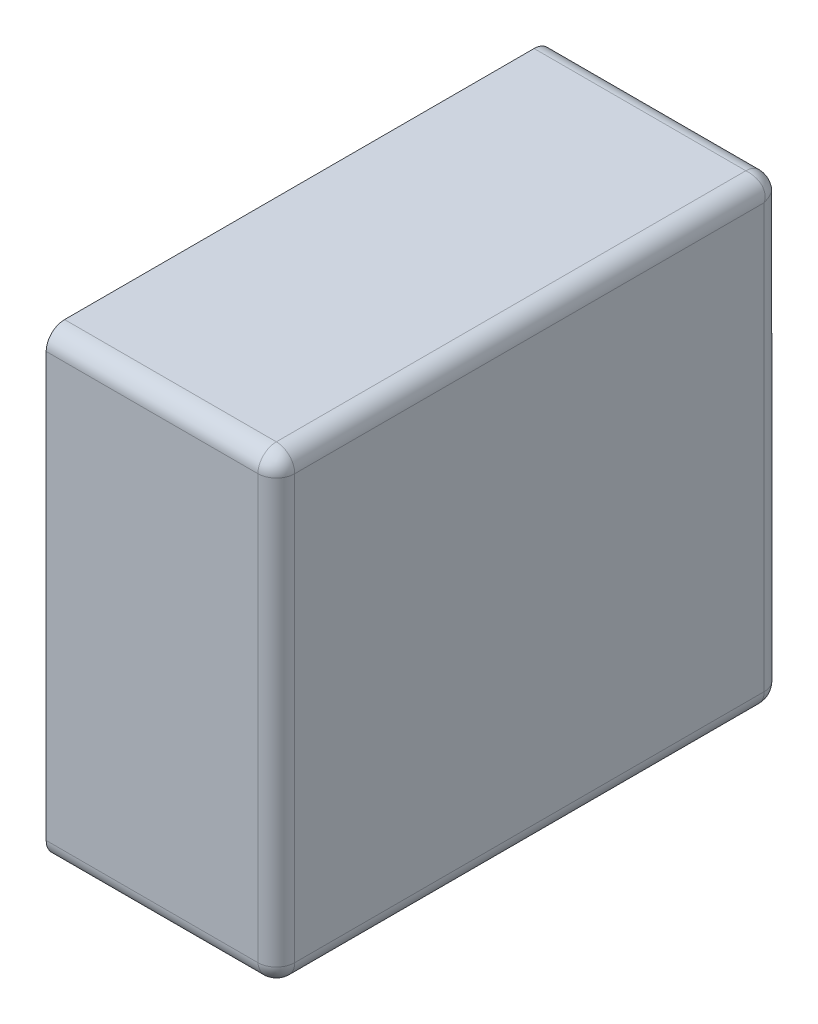
ISO-10303-21;
HEADER;
FILE_DESCRIPTION(('STEP AP214'),'2;1');
FILE_NAME('part.step','',(''),(''),'','','');
FILE_SCHEMA(('AUTOMOTIVE_DESIGN { 1 0 10303 214 1 1 1 1 }'));
ENDSEC;
DATA;
#1=APPLICATION_CONTEXT('core data for automotive mechanical design processes');
#2=APPLICATION_PROTOCOL_DEFINITION('international standard','automotive_design',2000,#1);
#3=PRODUCT_CONTEXT('',#1,'mechanical');
#4=PRODUCT('Part','Part','',(#3));
#5=PRODUCT_RELATED_PRODUCT_CATEGORY('part','',(#4));
#6=PRODUCT_DEFINITION_FORMATION('','',#4);
#7=PRODUCT_DEFINITION_CONTEXT('part definition',#1,'design');
#8=PRODUCT_DEFINITION('design','',#6,#7);
#9=PRODUCT_DEFINITION_SHAPE('','',#8);
#10=(LENGTH_UNIT() NAMED_UNIT(*) SI_UNIT(.MILLI.,.METRE.));
#11=(NAMED_UNIT(*) PLANE_ANGLE_UNIT() SI_UNIT($,.RADIAN.));
#12=(NAMED_UNIT(*) SI_UNIT($,.STERADIAN.) SOLID_ANGLE_UNIT());
#13=UNCERTAINTY_MEASURE_WITH_UNIT(LENGTH_MEASURE(1.E-05),#10,'distance_accuracy_value','');
#14=(GEOMETRIC_REPRESENTATION_CONTEXT(3) GLOBAL_UNCERTAINTY_ASSIGNED_CONTEXT((#13)) GLOBAL_UNIT_ASSIGNED_CONTEXT((#10,
#11,#12)) REPRESENTATION_CONTEXT('',''));
#15=CARTESIAN_POINT('',(0.,0.,0.));
#16=DIRECTION('',(0.,0.,1.));
#17=DIRECTION('',(1.,0.,0.));
#18=AXIS2_PLACEMENT_3D('',#15,#16,#17);
#19=CARTESIAN_POINT('',(0.28,0.411666689445808,0.02));
#20=DIRECTION('',(-0.816496580927727,-0.408248290463862,-0.408248290463863));
#21=DIRECTION('',(0.577350269189625,-0.577350269189626,-0.577350269189626));
#22=AXIS2_PLACEMENT_3D('',#19,#20,#21);
#23=SPHERICAL_SURFACE('',#22,0.02);
#24=CARTESIAN_POINT('',(0.28,0.411666689445808,0.02));
#25=DIRECTION('',(1.,0.,0.));
#26=DIRECTION('',(0.,0.,-1.));
#27=AXIS2_PLACEMENT_3D('',#24,#25,#26);
#28=CIRCLE('',#27,0.02);
#29=CARTESIAN_POINT('',(0.28,0.391666689445808,0.02));
#30=VERTEX_POINT('',#29);
#31=CARTESIAN_POINT('',(0.28,0.411666689445808,0.));
#32=VERTEX_POINT('',#31);
#33=EDGE_CURVE('E11',#30,#32,#28,.T.);
#34=ORIENTED_EDGE('',*,*,#33,.T.);
#35=CARTESIAN_POINT('',(0.28,0.411666689445808,0.02));
#36=DIRECTION('',(0.,-1.,0.));
#37=DIRECTION('',(1.,0.,0.));
#38=AXIS2_PLACEMENT_3D('',#35,#36,#37);
#39=CIRCLE('',#38,0.02);
#40=CARTESIAN_POINT('',(0.3,0.411666689445808,0.02));
#41=VERTEX_POINT('',#40);
#42=EDGE_CURVE('E24',#32,#41,#39,.T.);
#43=ORIENTED_EDGE('',*,*,#42,.T.);
#44=CARTESIAN_POINT('',(0.28,0.411666689445808,0.02));
#45=DIRECTION('',(0.,0.,-1.));
#46=DIRECTION('',(0.,-1.,0.));
#47=AXIS2_PLACEMENT_3D('',#44,#45,#46);
#48=CIRCLE('',#47,0.02);
#49=EDGE_CURVE('E287',#41,#30,#48,.T.);
#50=ORIENTED_EDGE('',*,*,#49,.T.);
#51=EDGE_LOOP('',(#34,#43,#50));
#52=FACE_BOUND('',#51,.T.);
#53=ADVANCED_FACE('F17',(#52),#23,.T.);
#54=CARTESIAN_POINT('',(0.28,0.411666689445808,0.53));
#55=DIRECTION('',(-0.408248290463862,-0.816496580927726,-0.408248290463864));
#56=DIRECTION('',(0.577350269189626,-0.577350269189626,0.577350269189626));
#57=AXIS2_PLACEMENT_3D('',#54,#55,#56);
#58=SPHERICAL_SURFACE('',#57,0.02);
#59=CARTESIAN_POINT('',(0.28,0.411666689445808,0.55));
#60=CARTESIAN_POINT('',(0.280022590656353,0.411334148474741,0.550000008125587));
#61=CARTESIAN_POINT('',(0.280048467324623,0.411001844995877,0.54999166852702));
#62=CARTESIAN_POINT('',(0.280106156478249,0.410337079746307,0.549958278226015));
#63=CARTESIAN_POINT('',(0.280137995200576,0.410004624017193,0.549933152347223));
#64=CARTESIAN_POINT('',(0.280206893868657,0.409340595003377,0.549866039031705));
#65=CARTESIAN_POINT('',(0.280243974413334,0.409009030727827,0.549823983801023));
#66=CARTESIAN_POINT('',(0.280322608326683,0.408347802787663,0.549722948959342));
#67=CARTESIAN_POINT('',(0.2803641771601,0.40801815010292,0.549663909585364));
#68=CARTESIAN_POINT('',(0.280451011501145,0.407361750546147,0.549528916956939));
#69=CARTESIAN_POINT('',(0.280496287947044,0.407035015675078,0.549452912423427));
#70=CARTESIAN_POINT('',(0.28058973767065,0.406385436639111,0.54928407811241));
#71=CARTESIAN_POINT('',(0.280637918049141,0.406062604537353,0.549191205873748));
#72=CARTESIAN_POINT('',(0.28073635687823,0.405421792978829,0.548988802105101));
#73=CARTESIAN_POINT('',(0.28078661935037,0.405103824708536,0.548879237125614));
#74=CARTESIAN_POINT('',(0.28088838941963,0.404473676032253,0.548643691360587));
#75=CARTESIAN_POINT('',(0.280939898771582,0.40416150502494,0.548517686194392));
#76=CARTESIAN_POINT('',(0.281043320324341,0.403543856078687,0.548249580526752));
#77=CARTESIAN_POINT('',(0.281095232865489,0.403238384878659,0.548107464633685));
#78=CARTESIAN_POINT('',(0.28119861409936,0.402635007501095,0.547807534142986));
#79=CARTESIAN_POINT('',(0.281250082594975,0.402337104579366,0.547649712927951));
#80=CARTESIAN_POINT('',(0.281351729565189,0.401749699416991,0.547318843351742));
#81=CARTESIAN_POINT('',(0.281401908192211,0.401460196183228,0.547145796800535));
#82=CARTESIAN_POINT('',(0.28150013473126,0.400890386886022,0.546785021438906));
#83=CARTESIAN_POINT('',(0.281548184027282,0.400610074880339,0.546597302391137));
#84=CARTESIAN_POINT('',(0.281641321625956,0.400059402677607,0.546207798282272));
#85=CARTESIAN_POINT('',(0.281686413406471,0.399789030962054,0.546006030339392));
#86=CARTESIAN_POINT('',(0.28177282100519,0.399258949646601,0.545589113715835));
#87=CARTESIAN_POINT('',(0.281814143222991,0.398999222404694,0.545373988796018));
#88=CARTESIAN_POINT('',(0.281892216861792,0.398491093743793,0.544931109843732));
#89=CARTESIAN_POINT('',(0.281928978383083,0.398242668098216,0.544703385393971));
#90=CARTESIAN_POINT('',(0.281997160659628,0.397757757689727,0.54423612233739));
#91=CARTESIAN_POINT('',(0.28202859593171,0.397521241746488,0.543996618215752));
#92=CARTESIAN_POINT('',(0.282085385217584,0.397060715335747,0.543506670756099));
#93=CARTESIAN_POINT('',(0.28211075880361,0.396836666462132,0.543256265798536));
#94=CARTESIAN_POINT('',(0.282154718170381,0.396401586733097,0.542745447935608));
#95=CARTESIAN_POINT('',(0.282173329127303,0.396190510075537,0.542485076223237));
#96=CARTESIAN_POINT('',(0.282203094935471,0.395781833927346,0.541955308494531));
#97=CARTESIAN_POINT('',(0.2822142810123,0.395584181174223,0.541685955339434));
#98=CARTESIAN_POINT('',(0.282228571117403,0.395202757491672,0.541139256511542));
#99=CARTESIAN_POINT('',(0.282231712751129,0.395018925884465,0.540861954178094));
#100=CARTESIAN_POINT('',(0.282229334285304,0.394665493809617,0.540300432434902));
#101=CARTESIAN_POINT('',(0.282223858375641,0.394495825406103,0.540016255624191));
#102=CARTESIAN_POINT('',(0.282203715057505,0.394171013111566,0.539442099273697));
#103=CARTESIAN_POINT('',(0.28218909849248,0.394015794297806,0.539152160365533));
#104=CARTESIAN_POINT('',(0.282150197448733,0.393720118275401,0.538567628183011));
#105=CARTESIAN_POINT('',(0.28212597039261,0.393579579543217,0.538273072358095));
#106=CARTESIAN_POINT('',(0.282067428373197,0.393313444361489,0.537680483339179));
#107=CARTESIAN_POINT('',(0.282033177188287,0.393187760288434,0.537382483235147));
#108=CARTESIAN_POINT('',(0.28195422644503,0.392951458983836,0.536784206815382));
#109=CARTESIAN_POINT('',(0.281909596642951,0.392840748641457,0.536483958108745));
#110=CARTESIAN_POINT('',(0.281809589319757,0.392634463115031,0.535882401170781));
#111=CARTESIAN_POINT('',(0.281754287007639,0.392538790058148,0.535581114055278));
#112=CARTESIAN_POINT('',(0.281632702159367,0.392362593769109,0.534978718554174));
#113=CARTESIAN_POINT('',(0.281566499584933,0.392281968717724,0.534677623814978));
#114=CARTESIAN_POINT('',(0.281422937490544,0.392135823168081,0.534076824171009));
#115=CARTESIAN_POINT('',(0.281345661932538,0.392070197866407,0.533777124916909));
#116=CARTESIAN_POINT('',(0.281221092947844,0.39198286595166,0.533328778203));
#117=CARTESIAN_POINT('',(0.281178255552711,0.391955665383831,0.533179933041728));
#118=CARTESIAN_POINT('',(0.281089772466679,0.391904985889448,0.532883054971346));
#119=CARTESIAN_POINT('',(0.281044137776449,0.391881493538696,0.532735021096781));
#120=CARTESIAN_POINT('',(0.280950059792531,0.391838212101501,0.532439925078264));
#121=CARTESIAN_POINT('',(0.280901627595711,0.391818409544562,0.532292861368746));
#122=CARTESIAN_POINT('',(0.280801956801604,0.391782484251369,0.531999856728976));
#123=CARTESIAN_POINT('',(0.280750729367382,0.391766348041082,0.531853913656674));
#124=CARTESIAN_POINT('',(0.280645475074276,0.391737729487318,0.531563302522279));
#125=CARTESIAN_POINT('',(0.280591459405113,0.391725233700399,0.53141863173285));
#126=CARTESIAN_POINT('',(0.280480639915912,0.391703866846108,0.531130715857044));
#127=CARTESIAN_POINT('',(0.28042384727353,0.391694982403244,0.530987467462735));
#128=CARTESIAN_POINT('',(0.28030748910873,0.391680806437444,0.530702545780637));
#129=CARTESIAN_POINT('',(0.280247934713586,0.391675501642837,0.530560868611608));
#130=CARTESIAN_POINT('',(0.280126073989553,0.391668449415601,0.530279238132867));
#131=CARTESIAN_POINT('',(0.280063778692528,0.391666688855447,0.530139280377173));
#132=CARTESIAN_POINT('',(0.28,0.391666689445808,0.53));
#133=B_SPLINE_CURVE_WITH_KNOTS('',3,(#59,#60,#61,#62,#63,#64,#65,#66,#67,#68,#69,#70,#71,#72,
#73,#74,#75,#76,#77,#78,#79,#80,#81,#82,#83,#84,#85,#86,#87,#88,#89,#90,#91,#92,#93,#94,#95,#96,
#97,#98,#99,#100,#101,#102,#103,#104,#105,#106,#107,#108,#109,#110,#111,#112,#113,#114,#115,
#116,#117,#118,#119,#120,#121,#122,#123,#124,#125,#126,#127,#128,#129,#130,#131,#132),
.UNSPECIFIED.,.F.,.F.,(4,2,2,2,2,2,2,2,2,2,2,2,2,2,2,2,2,2,2,2,2,2,2,2,2,2,2,2,2,2,2,2,2,2,2,2,
4),(0.,0.000999781399315434,0.00200407054494469,0.00301242204398967,0.00402436601448965,
0.00503941114405152,0.00605704778834479,0.00707675110110719,0.00809798418851637,
0.00912020128176303,0.0101428509224156,0.0111653791557147,0.0121872327272804,0.0132078622788662,
0.0142267255387507,0.0152432905021242,0.0162570385963918,0.0172674678256811,0.0182740958879865,
0.0192764632573068,0.0202741362218111,0.0212667098675017,0.0222538109950035,0.0232351009550113,
0.0242102783855514,0.0251790818315857,0.0261412922246293,0.0270967351970058,0.028045283202207,
0.0285169970770675,0.0289869620593238,0.0294551761814861,0.0299216407082721,0.0303863601707293,
0.0308493423947613,0.0313105985237337,0.0317701430348329),.UNSPECIFIED.);
#134=CARTESIAN_POINT('',(0.28,0.411666689445808,0.55));
#135=VERTEX_POINT('',#134);
#136=CARTESIAN_POINT('',(0.28,0.391666689445808,0.53));
#137=VERTEX_POINT('',#136);
#138=EDGE_CURVE('E285',#135,#137,#133,.T.);
#139=ORIENTED_EDGE('',*,*,#138,.T.);
#140=CARTESIAN_POINT('',(0.28,0.411666689445808,0.53));
#141=DIRECTION('',(0.,0.,1.));
#142=DIRECTION('',(1.,0.,0.));
#143=AXIS2_PLACEMENT_3D('',#140,#141,#142);
#144=CIRCLE('',#143,0.02);
#145=CARTESIAN_POINT('',(0.3,0.411666689445808,0.53));
#146=VERTEX_POINT('',#145);
#147=EDGE_CURVE('E321',#137,#146,#144,.T.);
#148=ORIENTED_EDGE('',*,*,#147,.T.);
#149=CARTESIAN_POINT('',(0.28,0.411666689445808,0.53));
#150=DIRECTION('',(0.,-1.,0.));
#151=DIRECTION('',(0.,0.,1.));
#152=AXIS2_PLACEMENT_3D('',#149,#150,#151);
#153=CIRCLE('',#152,0.02);
#154=EDGE_CURVE('E319',#146,#135,#153,.T.);
#155=ORIENTED_EDGE('',*,*,#154,.T.);
#156=EDGE_LOOP('',(#139,#148,#155));
#157=FACE_BOUND('',#156,.T.);
#158=ADVANCED_FACE('F262',(#157),#58,.T.);
#159=CARTESIAN_POINT('',(0.28,0.411666689445808,0.));
#160=DIRECTION('',(0.,0.,1.));
#161=DIRECTION('',(0.707106781186548,-0.707106781186548,0.));
#162=AXIS2_PLACEMENT_3D('',#159,#160,#161);
#163=CYLINDRICAL_SURFACE('',#162,0.02);
#164=ORIENTED_EDGE('',*,*,#147,.F.);
#165=DIRECTION('',(0.,0.,-1.));
#166=VECTOR('',#165,1.);
#167=CARTESIAN_POINT('',(0.28,0.391666689445808,0.));
#168=LINE('',#167,#166);
#169=EDGE_CURVE('E295',#137,#30,#168,.T.);
#170=ORIENTED_EDGE('',*,*,#169,.T.);
#171=ORIENTED_EDGE('',*,*,#49,.F.);
#172=DIRECTION('',(0.,0.,1.));
#173=VECTOR('',#172,1.);
#174=CARTESIAN_POINT('',(0.3,0.411666689445808,0.));
#175=LINE('',#174,#173);
#176=EDGE_CURVE('E293',#41,#146,#175,.T.);
#177=ORIENTED_EDGE('',*,*,#176,.T.);
#178=EDGE_LOOP('',(#164,#170,#171,#177));
#179=FACE_BOUND('',#178,.T.);
#180=ADVANCED_FACE('F214',(#179),#163,.T.);
#181=CARTESIAN_POINT('',(0.28,0.871666689445808,0.02));
#182=DIRECTION('',(-0.816496580927727,0.408248290463863,-0.408248290463861));
#183=DIRECTION('',(0.577350269189624,0.577350269189626,-0.577350269189628));
#184=AXIS2_PLACEMENT_3D('',#181,#182,#183);
#185=SPHERICAL_SURFACE('',#184,0.02);
#186=CARTESIAN_POINT('',(0.3,0.871666689445808,0.02));
#187=CARTESIAN_POINT('',(0.300000000590361,0.871730468138336,0.0198607196228271));
#188=CARTESIAN_POINT('',(0.299998240030207,0.871792763435361,0.0197207618671335));
#189=CARTESIAN_POINT('',(0.299991187802971,0.871914624159394,0.0194391313883916));
#190=CARTESIAN_POINT('',(0.299985883008364,0.871974178554538,0.0192974542193625));
#191=CARTESIAN_POINT('',(0.299971707042564,0.872090536719337,0.0190125325372646));
#192=CARTESIAN_POINT('',(0.2999628225997,0.87214732936172,0.018869284142956));
#193=CARTESIAN_POINT('',(0.299941455745409,0.872258148850921,0.0185813682671499));
#194=CARTESIAN_POINT('',(0.299928959958489,0.872312164520084,0.0184366974777213));
#195=CARTESIAN_POINT('',(0.299900341404726,0.87241741881319,0.0181460863433266));
#196=CARTESIAN_POINT('',(0.299884205194439,0.872468646247412,0.0180001432710243));
#197=CARTESIAN_POINT('',(0.299848279901245,0.872568317041519,0.0177071386312541));
#198=CARTESIAN_POINT('',(0.299828477344307,0.872616749238339,0.0175600749217357));
#199=CARTESIAN_POINT('',(0.299785195907112,0.872710827222257,0.0172649789032189));
#200=CARTESIAN_POINT('',(0.29976170355636,0.872756461912487,0.0171169450286536));
#201=CARTESIAN_POINT('',(0.299711024061977,0.872844944998519,0.0168200669582726));
#202=CARTESIAN_POINT('',(0.299683823494148,0.872887782393652,0.0166712217969997));
#203=CARTESIAN_POINT('',(0.299596491579401,0.873012351378346,0.0162228750830907));
#204=CARTESIAN_POINT('',(0.299530866277727,0.873089626936352,0.0159231758289911));
#205=CARTESIAN_POINT('',(0.299384720728084,0.873233189030742,0.0153223761850222));
#206=CARTESIAN_POINT('',(0.299304095676699,0.873299391605175,0.0150212814458264));
#207=CARTESIAN_POINT('',(0.29912789938766,0.873420976453447,0.0144188859447218));
#208=CARTESIAN_POINT('',(0.299032226330777,0.873476278765565,0.0141175988292196));
#209=CARTESIAN_POINT('',(0.298825940804351,0.873576286088758,0.0135160418912551));
#210=CARTESIAN_POINT('',(0.298715230461972,0.873620915890838,0.0132157931846183));
#211=CARTESIAN_POINT('',(0.298478929157374,0.873699866634095,0.0126175167648527));
#212=CARTESIAN_POINT('',(0.298353245084319,0.873734117819005,0.012319516660821));
#213=CARTESIAN_POINT('',(0.298087109902591,0.873792659838418,0.0117269276419048));
#214=CARTESIAN_POINT('',(0.297946571170407,0.873816886894541,0.0114323718169895));
#215=CARTESIAN_POINT('',(0.297650895148002,0.873855787938288,0.0108478396344671));
#216=CARTESIAN_POINT('',(0.297495676334242,0.873870404503313,0.0105579007263027));
#217=CARTESIAN_POINT('',(0.297170864039705,0.873890547821449,0.00998374437580919));
#218=CARTESIAN_POINT('',(0.297001195636191,0.873896023731112,0.00969956756509782));
#219=CARTESIAN_POINT('',(0.296647763561343,0.873898402196938,0.00913804582190597));
#220=CARTESIAN_POINT('',(0.296463931954136,0.873895260563211,0.00886074348845804));
#221=CARTESIAN_POINT('',(0.296082508271585,0.873880970458108,0.00831404466056605));
#222=CARTESIAN_POINT('',(0.295884855518462,0.873869784381279,0.00804469150546922));
#223=CARTESIAN_POINT('',(0.29547617937027,0.873840018573111,0.00751492377676279));
#224=CARTESIAN_POINT('',(0.29526510271271,0.87382140761619,0.00725455206439161));
#225=CARTESIAN_POINT('',(0.294830022983676,0.873777448249418,0.00674373420146366));
#226=CARTESIAN_POINT('',(0.294605974110061,0.873752074663392,0.00649332924390105));
#227=CARTESIAN_POINT('',(0.29414544769932,0.873695285377518,0.00600338178424781));
#228=CARTESIAN_POINT('',(0.293908931756081,0.873663850105436,0.00576387766260968));
#229=CARTESIAN_POINT('',(0.293424021347592,0.873595667828891,0.00529661460602938));
#230=CARTESIAN_POINT('',(0.293175595702015,0.8735589063076,0.00506889015626833));
#231=CARTESIAN_POINT('',(0.292667467041114,0.873480832668799,0.00462601120398246));
#232=CARTESIAN_POINT('',(0.292407739799207,0.873439510450998,0.00441088628416467));
#233=CARTESIAN_POINT('',(0.291877658483754,0.873353102852279,0.00399396966060765));
#234=CARTESIAN_POINT('',(0.291607286768201,0.873308011071765,0.00379220171772828));
#235=CARTESIAN_POINT('',(0.291056614565469,0.87321487347309,0.00340269760886272));
#236=CARTESIAN_POINT('',(0.290776302559786,0.873166824177068,0.00321497856109427));
#237=CARTESIAN_POINT('',(0.29020649326258,0.873068597638019,0.00285420319946529));
#238=CARTESIAN_POINT('',(0.289916990028816,0.873018419010997,0.00268115664825788));
#239=CARTESIAN_POINT('',(0.289329584866442,0.872916772040783,0.00235028707204871));
#240=CARTESIAN_POINT('',(0.289031681944713,0.872865303545168,0.00219246585701409));
#241=CARTESIAN_POINT('',(0.288428304567149,0.872761922311297,0.00189253536631513));
#242=CARTESIAN_POINT('',(0.288122833367121,0.872710009770149,0.00175041947324791));
#243=CARTESIAN_POINT('',(0.287505184420868,0.87260658821739,0.00148231380560814));
#244=CARTESIAN_POINT('',(0.287193013413555,0.872555078865438,0.0013563086394134));
#245=CARTESIAN_POINT('',(0.286562864737272,0.872453308796178,0.00112076287438578));
#246=CARTESIAN_POINT('',(0.286244896466979,0.872403046324038,0.00101119789489932));
#247=CARTESIAN_POINT('',(0.285604084908455,0.872304607494949,0.000808794126252359));
#248=CARTESIAN_POINT('',(0.285281252806697,0.872256427116458,0.000715921887590404));
#249=CARTESIAN_POINT('',(0.28463167377073,0.872162977392852,0.000547087576573233));
#250=CARTESIAN_POINT('',(0.284304938899661,0.872117700946953,0.000471083043060662));
#251=CARTESIAN_POINT('',(0.283648539342888,0.872030866605908,0.00033609041463642));
#252=CARTESIAN_POINT('',(0.283318886658145,0.871989297772491,0.000277051040657805));
#253=CARTESIAN_POINT('',(0.282657658717981,0.871910663859142,0.000176016198976993));
#254=CARTESIAN_POINT('',(0.282326094442431,0.871873583314465,0.000133960968295318));
#255=CARTESIAN_POINT('',(0.281662065428615,0.871804684646384,6.68476527768222E-05));
#256=CARTESIAN_POINT('',(0.281329609699501,0.871772845924057,4.17217739850229E-05));
#257=CARTESIAN_POINT('',(0.280664844449931,0.871715156770431,8.33147298054421E-06));
#258=CARTESIAN_POINT('',(0.280332540971067,0.871689280102161,-8.12558677261846E-09));
#259=CARTESIAN_POINT('',(0.28,0.871666689445808,0.));
#260=B_SPLINE_CURVE_WITH_KNOTS('',3,(#186,#187,#188,#189,#190,#191,#192,#193,#194,#195,#196,
#197,#198,#199,#200,#201,#202,#203,#204,#205,#206,#207,#208,#209,#210,#211,#212,#213,#214,#215,
#216,#217,#218,#219,#220,#221,#222,#223,#224,#225,#226,#227,#228,#229,#230,#231,#232,#233,#234,
#235,#236,#237,#238,#239,#240,#241,#242,#243,#244,#245,#246,#247,#248,#249,#250,#251,#252,#253,
#254,#255,#256,#257,#258,#259),.UNSPECIFIED.,.F.,.F.,(4,2,2,2,2,2,2,2,2,2,2,2,2,2,2,2,2,2,2,2,2,
2,2,2,2,2,2,2,2,2,2,2,2,2,2,2,4),(0.,0.000459544511099279,0.000920800640071707,
0.00138378286410355,0.0018485023265608,0.00231496685334685,0.00278318097550909,
0.00325314595776555,0.00372485983262588,0.00467340783782725,0.00562885081020362,
0.00659106120324724,0.00755986464928153,0.00853504207982159,0.00951633203982944,
0.0105034331673312,0.0114960068130218,0.0124936797775262,0.0134960471468464,0.0145026752091519,
0.0155131044384412,0.0165268525327087,0.0175434174960822,0.0185622807559668,0.0195829103075526,
0.0206047638791183,0.0216272921124173,0.0226499417530699,0.0236721588463166,0.0246933919337258,
0.0257130952464882,0.0267307318907814,0.0277457770203433,0.0287577209908433,0.0297660724898882,
0.0307703616355175,0.031770143034833),.UNSPECIFIED.);
#261=CARTESIAN_POINT('',(0.3,0.871666689445808,0.02));
#262=VERTEX_POINT('',#261);
#263=CARTESIAN_POINT('',(0.28,0.871666689445808,0.));
#264=VERTEX_POINT('',#263);
#265=EDGE_CURVE('E236',#262,#264,#260,.T.);
#266=ORIENTED_EDGE('',*,*,#265,.T.);
#267=CARTESIAN_POINT('',(0.28,0.871666689445808,0.02));
#268=DIRECTION('',(1.,0.,0.));
#269=DIRECTION('',(0.,1.,0.));
#270=AXIS2_PLACEMENT_3D('',#267,#268,#269);
#271=CIRCLE('',#270,0.02);
#272=CARTESIAN_POINT('',(0.28,0.891666689445808,0.02));
#273=VERTEX_POINT('',#272);
#274=EDGE_CURVE('E234',#264,#273,#271,.T.);
#275=ORIENTED_EDGE('',*,*,#274,.T.);
#276=CARTESIAN_POINT('',(0.28,0.891666689445808,0.02));
#277=CARTESIAN_POINT('',(0.280332540971067,0.891666697571395,0.0199774093436473));
#278=CARTESIAN_POINT('',(0.280664844449931,0.891658357972828,0.0199515326753773));
#279=CARTESIAN_POINT('',(0.281329609699501,0.891624967671823,0.0198938435217508));
#280=CARTESIAN_POINT('',(0.281662065428615,0.891599841793031,0.0198620047994243));
#281=CARTESIAN_POINT('',(0.282326094442431,0.891532728477513,0.0197931061313426));
#282=CARTESIAN_POINT('',(0.282657658717981,0.891490673246831,0.0197560255866657));
#283=CARTESIAN_POINT('',(0.283318886658145,0.89138963840515,0.0196773916733174));
#284=CARTESIAN_POINT('',(0.283648539342888,0.891330599031172,0.0196358228398999));
#285=CARTESIAN_POINT('',(0.284304938899661,0.891195606402747,0.0195489884988552));
#286=CARTESIAN_POINT('',(0.28463167377073,0.891119601869235,0.0195037120529565));
#287=CARTESIAN_POINT('',(0.285281252806697,0.890950767558218,0.0194102623293496));
#288=CARTESIAN_POINT('',(0.285604084908455,0.890857895319556,0.0193620819508587));
#289=CARTESIAN_POINT('',(0.286244896466979,0.890655491550909,0.0192636431217698));
#290=CARTESIAN_POINT('',(0.286562864737272,0.890545926571422,0.0192133806496299));
#291=CARTESIAN_POINT('',(0.287193013413555,0.890310380806395,0.0191116105803702));
#292=CARTESIAN_POINT('',(0.287505184420868,0.8901843756402,0.0190601012284176));
#293=CARTESIAN_POINT('',(0.288122833367121,0.88991626997256,0.0189566796756587));
#294=CARTESIAN_POINT('',(0.288428304567149,0.889774154079493,0.018904767134511));
#295=CARTESIAN_POINT('',(0.289031681944713,0.889474223588794,0.0188013859006402));
#296=CARTESIAN_POINT('',(0.289329584866442,0.889316402373759,0.0187499174050251));
#297=CARTESIAN_POINT('',(0.289916990028817,0.88898553279755,0.0186482704348113));
#298=CARTESIAN_POINT('',(0.29020649326258,0.888812486246343,0.0185980918077888));
#299=CARTESIAN_POINT('',(0.290776302559786,0.888451710884714,0.0184998652687403));
#300=CARTESIAN_POINT('',(0.291056614565469,0.888263991836945,0.018451815972718));
#301=CARTESIAN_POINT('',(0.291607286768201,0.88787448772808,0.0183586783740435));
#302=CARTESIAN_POINT('',(0.291877658483754,0.8876727197852,0.0183135865935291));
#303=CARTESIAN_POINT('',(0.292407739799207,0.887255803161643,0.0182271789948101));
#304=CARTESIAN_POINT('',(0.292667467041114,0.887040678241826,0.0181858567770088));
#305=CARTESIAN_POINT('',(0.293175595702015,0.88659779928954,0.0181077831382082));
#306=CARTESIAN_POINT('',(0.293424021347592,0.886370074839779,0.0180710216169169));
#307=CARTESIAN_POINT('',(0.293908931756081,0.885902811783198,0.0180028393403716));
#308=CARTESIAN_POINT('',(0.29414544769932,0.88566330766156,0.0179714040682899));
#309=CARTESIAN_POINT('',(0.294605974110061,0.885173360201907,0.0179146147824163));
#310=CARTESIAN_POINT('',(0.294830022983676,0.884922955244344,0.0178892411963896));
#311=CARTESIAN_POINT('',(0.29526510271271,0.884412137381416,0.0178452818296186));
#312=CARTESIAN_POINT('',(0.295476179370271,0.884151765669045,0.0178266708726966));
#313=CARTESIAN_POINT('',(0.295884855518462,0.883621997940339,0.0177969050645286));
#314=CARTESIAN_POINT('',(0.296082508271585,0.883352644785242,0.0177857189876999));
#315=CARTESIAN_POINT('',(0.296463931954136,0.88280594595735,0.0177714288825966));
#316=CARTESIAN_POINT('',(0.296647763561343,0.882528643623902,0.0177682872488705));
#317=CARTESIAN_POINT('',(0.297001195636191,0.88196712188071,0.0177706657146956));
#318=CARTESIAN_POINT('',(0.297170864039705,0.881682945069999,0.0177761416243585));
#319=CARTESIAN_POINT('',(0.297495676334242,0.881108788719505,0.0177962849424949));
#320=CARTESIAN_POINT('',(0.297650895148002,0.880818849811341,0.0178109015075204));
#321=CARTESIAN_POINT('',(0.297946571170407,0.880234317628819,0.0178498025512674));
#322=CARTESIAN_POINT('',(0.298087109902591,0.879939761803903,0.0178740296073897));
#323=CARTESIAN_POINT('',(0.298353245084319,0.879347172784987,0.0179325716268031));
#324=CARTESIAN_POINT('',(0.298478929157374,0.879049172680955,0.0179668228117131));
#325=CARTESIAN_POINT('',(0.298715230461972,0.87845089626119,0.01804577355497));
#326=CARTESIAN_POINT('',(0.298825940804351,0.878150647554553,0.0180904033570495));
#327=CARTESIAN_POINT('',(0.299032226330777,0.877549090616588,0.0181904106802428));
#328=CARTESIAN_POINT('',(0.29912789938766,0.877247803501086,0.0182457129923607));
#329=CARTESIAN_POINT('',(0.299304095676699,0.876645407999982,0.0183672978406332));
#330=CARTESIAN_POINT('',(0.299384720728084,0.876344313260786,0.0184335004150665));
#331=CARTESIAN_POINT('',(0.299530866277727,0.875743513616817,0.0185770625094562));
#332=CARTESIAN_POINT('',(0.299596491579401,0.875443814362717,0.0186543380674616));
#333=CARTESIAN_POINT('',(0.299683823494148,0.874995467648808,0.0187789070521562));
#334=CARTESIAN_POINT('',(0.299711024061977,0.874846622487536,0.0188217444472892));
#335=CARTESIAN_POINT('',(0.29976170355636,0.874549744417154,0.018910227533321));
#336=CARTESIAN_POINT('',(0.299785195907112,0.874401710542589,0.0189558622235505));
#337=CARTESIAN_POINT('',(0.299828477344307,0.874106614524072,0.019049940207469));
#338=CARTESIAN_POINT('',(0.299848279901245,0.873959550814554,0.0190983724042887));
#339=CARTESIAN_POINT('',(0.299884205194439,0.873666546174784,0.0191980431983957));
#340=CARTESIAN_POINT('',(0.299900341404726,0.873520603102481,0.019249270632618));
#341=CARTESIAN_POINT('',(0.299928959958489,0.873229991968087,0.0193545249257238));
#342=CARTESIAN_POINT('',(0.299941455745409,0.873085321178658,0.0194085405948874));
#343=CARTESIAN_POINT('',(0.2999628225997,0.872797405302852,0.0195193600840876));
#344=CARTESIAN_POINT('',(0.299971707042564,0.872654156908544,0.0195761527264704));
#345=CARTESIAN_POINT('',(0.299985883008364,0.872369235226446,0.0196925108912696));
#346=CARTESIAN_POINT('',(0.299991187802971,0.872227558057416,0.0197520652864141));
#347=CARTESIAN_POINT('',(0.299998240030207,0.871945927578675,0.0198739260104468));
#348=CARTESIAN_POINT('',(0.300000000590361,0.871805969822981,0.0199362213074718));
#349=CARTESIAN_POINT('',(0.3,0.871666689445808,0.0199999999999999));
#350=B_SPLINE_CURVE_WITH_KNOTS('',3,(#276,#277,#278,#279,#280,#281,#282,#283,#284,#285,#286,
#287,#288,#289,#290,#291,#292,#293,#294,#295,#296,#297,#298,#299,#300,#301,#302,#303,#304,#305,
#306,#307,#308,#309,#310,#311,#312,#313,#314,#315,#316,#317,#318,#319,#320,#321,#322,#323,#324,
#325,#326,#327,#328,#329,#330,#331,#332,#333,#334,#335,#336,#337,#338,#339,#340,#341,#342,#343,
#344,#345,#346,#347,#348,#349),.UNSPECIFIED.,.F.,.F.,(4,2,2,2,2,2,2,2,2,2,2,2,2,2,2,2,2,2,2,2,2,
2,2,2,2,2,2,2,2,2,2,2,2,2,2,2,4),(0.,0.000999781399315437,0.0020040705449447,
0.00301242204398967,0.00402436601448971,0.00503941114405157,0.00605704778834485,
0.0070767511011072,0.00809798418851638,0.00912020128176308,0.0101428509224156,
0.0111653791557147,0.0121872327272804,0.0132078622788662,0.0142267255387507,0.0152432905021242,
0.0162570385963919,0.0172674678256811,0.0182740958879865,0.0192764632573068,0.0202741362218111,
0.0212667098675017,0.0222538109950035,0.0232351009550113,0.0242102783855514,0.0251790818315857,
0.0261412922246293,0.0270967351970057,0.028045283202207,0.0285169970770674,0.0289869620593239,
0.0294551761814861,0.0299216407082721,0.0303863601707294,0.0308493423947612,0.0313105985237336,
0.031770143034833),.UNSPECIFIED.);
#351=EDGE_CURVE('E182',#273,#262,#350,.T.);
#352=ORIENTED_EDGE('',*,*,#351,.T.);
#353=EDGE_LOOP('',(#266,#275,#352));
#354=FACE_BOUND('',#353,.T.);
#355=ADVANCED_FACE('F209',(#354),#185,.T.);
#356=CARTESIAN_POINT('',(0.2375,0.871666689445808,0.02));
#357=DIRECTION('',(1.,0.,0.));
#358=DIRECTION('',(0.,0.707106781186548,-0.707106781186547));
#359=AXIS2_PLACEMENT_3D('',#356,#357,#358);
#360=CYLINDRICAL_SURFACE('',#359,0.02);
#361=CARTESIAN_POINT('',(0.05,0.871666689445808,0.02));
#362=DIRECTION('',(1.,0.,0.));
#363=DIRECTION('',(0.,0.707106781186548,-0.707106781186547));
#364=AXIS2_PLACEMENT_3D('',#361,#362,#363);
#365=CIRCLE('',#364,0.02);
#366=CARTESIAN_POINT('',(0.05,0.871666689445808,0.));
#367=VERTEX_POINT('',#366);
#368=CARTESIAN_POINT('',(0.05,0.891666689445808,0.02));
#369=VERTEX_POINT('',#368);
#370=EDGE_CURVE('E180',#367,#369,#365,.T.);
#371=ORIENTED_EDGE('',*,*,#370,.T.);
#372=DIRECTION('',(1.,0.,0.));
#373=VECTOR('',#372,1.);
#374=CARTESIAN_POINT('',(0.2375,0.891666689445808,0.02));
#375=LINE('',#374,#373);
#376=EDGE_CURVE('E175',#369,#273,#375,.T.);
#377=ORIENTED_EDGE('',*,*,#376,.T.);
#378=ORIENTED_EDGE('',*,*,#274,.F.);
#379=DIRECTION('',(-1.,0.,0.));
#380=VECTOR('',#379,1.);
#381=CARTESIAN_POINT('',(0.2375,0.871666689445808,0.));
#382=LINE('',#381,#380);
#383=EDGE_CURVE('E170',#264,#367,#382,.T.);
#384=ORIENTED_EDGE('',*,*,#383,.T.);
#385=EDGE_LOOP('',(#371,#377,#378,#384));
#386=FACE_BOUND('',#385,.T.);
#387=ADVANCED_FACE('F205',(#386),#360,.T.);
#388=CARTESIAN_POINT('',(0.28,0.871666689445808,0.53));
#389=DIRECTION('',(0.408248290463863,-0.816496580927726,0.408248290463863));
#390=DIRECTION('',(0.577350269189626,0.577350269189626,0.577350269189626));
#391=AXIS2_PLACEMENT_3D('',#388,#389,#390);
#392=SPHERICAL_SURFACE('',#391,0.02);
#393=CARTESIAN_POINT('',(0.28,0.871666689445808,0.53));
#394=DIRECTION('',(0.,1.,0.));
#395=DIRECTION('',(1.,0.,0.));
#396=AXIS2_PLACEMENT_3D('',#393,#394,#395);
#397=CIRCLE('',#396,0.02);
#398=CARTESIAN_POINT('',(0.28,0.871666689445808,0.55));
#399=VERTEX_POINT('',#398);
#400=CARTESIAN_POINT('',(0.3,0.871666689445808,0.53));
#401=VERTEX_POINT('',#400);
#402=EDGE_CURVE('E168',#399,#401,#397,.T.);
#403=ORIENTED_EDGE('',*,*,#402,.T.);
#404=CARTESIAN_POINT('',(0.28,0.871666689445808,0.53));
#405=DIRECTION('',(0.,0.,1.));
#406=DIRECTION('',(0.,1.,0.));
#407=AXIS2_PLACEMENT_3D('',#404,#405,#406);
#408=CIRCLE('',#407,0.02);
#409=CARTESIAN_POINT('',(0.28,0.891666689445808,0.53));
#410=VERTEX_POINT('',#409);
#411=EDGE_CURVE('E166',#401,#410,#408,.T.);
#412=ORIENTED_EDGE('',*,*,#411,.T.);
#413=CARTESIAN_POINT('',(0.28,0.871666689445808,0.53));
#414=DIRECTION('',(1.,0.,0.));
#415=DIRECTION('',(0.,0.,1.));
#416=AXIS2_PLACEMENT_3D('',#413,#414,#415);
#417=CIRCLE('',#416,0.02);
#418=EDGE_CURVE('E163',#410,#399,#417,.T.);
#419=ORIENTED_EDGE('',*,*,#418,.T.);
#420=EDGE_LOOP('',(#403,#412,#419));
#421=FACE_BOUND('',#420,.T.);
#422=ADVANCED_FACE('F200',(#421),#392,.T.);
#423=CARTESIAN_POINT('',(0.28,0.871666689445808,0.));
#424=DIRECTION('',(0.,0.,1.));
#425=DIRECTION('',(0.707106781186546,0.707106781186549,0.));
#426=AXIS2_PLACEMENT_3D('',#423,#424,#425);
#427=CYLINDRICAL_SURFACE('',#426,0.02);
#428=ORIENTED_EDGE('',*,*,#411,.F.);
#429=DIRECTION('',(0.,0.,-1.));
#430=VECTOR('',#429,1.);
#431=CARTESIAN_POINT('',(0.3,0.871666689445808,0.));
#432=LINE('',#431,#430);
#433=EDGE_CURVE('E158',#401,#262,#432,.T.);
#434=ORIENTED_EDGE('',*,*,#433,.T.);
#435=ORIENTED_EDGE('',*,*,#351,.F.);
#436=DIRECTION('',(0.,0.,1.));
#437=VECTOR('',#436,1.);
#438=CARTESIAN_POINT('',(0.28,0.891666689445808,0.));
#439=LINE('',#438,#437);
#440=EDGE_CURVE('E153',#273,#410,#439,.T.);
#441=ORIENTED_EDGE('',*,*,#440,.T.);
#442=EDGE_LOOP('',(#428,#434,#435,#441));
#443=FACE_BOUND('',#442,.T.);
#444=ADVANCED_FACE('F189',(#443),#427,.T.);
#445=CARTESIAN_POINT('',(0.2375,0.871666689445808,0.53));
#446=DIRECTION('',(-1.,0.,0.));
#447=DIRECTION('',(0.,0.707106781186548,0.707106781186548));
#448=AXIS2_PLACEMENT_3D('',#445,#446,#447);
#449=CYLINDRICAL_SURFACE('',#448,0.02);
#450=CARTESIAN_POINT('',(0.05,0.871666689445808,0.53));
#451=DIRECTION('',(1.,0.,0.));
#452=DIRECTION('',(0.,0.707106781186548,0.707106781186548));
#453=AXIS2_PLACEMENT_3D('',#450,#451,#452);
#454=CIRCLE('',#453,0.02);
#455=CARTESIAN_POINT('',(0.05,0.891666689445808,0.53));
#456=VERTEX_POINT('',#455);
#457=CARTESIAN_POINT('',(0.05,0.871666689445808,0.55));
#458=VERTEX_POINT('',#457);
#459=EDGE_CURVE('E151',#456,#458,#454,.T.);
#460=ORIENTED_EDGE('',*,*,#459,.T.);
#461=DIRECTION('',(1.,0.,0.));
#462=VECTOR('',#461,1.);
#463=CARTESIAN_POINT('',(0.2375,0.871666689445808,0.55));
#464=LINE('',#463,#462);
#465=EDGE_CURVE('E148',#458,#399,#464,.T.);
#466=ORIENTED_EDGE('',*,*,#465,.T.);
#467=ORIENTED_EDGE('',*,*,#418,.F.);
#468=DIRECTION('',(-1.,0.,0.));
#469=VECTOR('',#468,1.);
#470=CARTESIAN_POINT('',(0.2375,0.891666689445808,0.53));
#471=LINE('',#470,#469);
#472=EDGE_CURVE('E145',#410,#456,#471,.T.);
#473=ORIENTED_EDGE('',*,*,#472,.T.);
#474=EDGE_LOOP('',(#460,#466,#467,#473));
#475=FACE_BOUND('',#474,.T.);
#476=ADVANCED_FACE('F199',(#475),#449,.T.);
#477=CARTESIAN_POINT('',(0.28,0.516666689445808,0.53));
#478=DIRECTION('',(0.,1.,0.));
#479=DIRECTION('',(0.707106781186548,0.,0.707106781186548));
#480=AXIS2_PLACEMENT_3D('',#477,#478,#479);
#481=CYLINDRICAL_SURFACE('',#480,0.02);
#482=ORIENTED_EDGE('',*,*,#402,.F.);
#483=DIRECTION('',(0.,-1.,0.));
#484=VECTOR('',#483,1.);
#485=CARTESIAN_POINT('',(0.28,0.516666689445808,0.55));
#486=LINE('',#485,#484);
#487=EDGE_CURVE('E140',#399,#135,#486,.T.);
#488=ORIENTED_EDGE('',*,*,#487,.T.);
#489=ORIENTED_EDGE('',*,*,#154,.F.);
#490=DIRECTION('',(0.,1.,0.));
#491=VECTOR('',#490,1.);
#492=CARTESIAN_POINT('',(0.3,0.516666689445808,0.53));
#493=LINE('',#492,#491);
#494=EDGE_CURVE('E137',#146,#401,#493,.T.);
#495=ORIENTED_EDGE('',*,*,#494,.T.);
#496=EDGE_LOOP('',(#482,#488,#489,#495));
#497=FACE_BOUND('',#496,.T.);
#498=ADVANCED_FACE('F250',(#497),#481,.T.);
#499=CARTESIAN_POINT('',(0.28,0.516666689445808,0.02));
#500=DIRECTION('',(0.,-1.,0.));
#501=DIRECTION('',(0.707106781186548,0.,-0.707106781186547));
#502=AXIS2_PLACEMENT_3D('',#499,#500,#501);
#503=CYLINDRICAL_SURFACE('',#502,0.02);
#504=ORIENTED_EDGE('',*,*,#42,.F.);
#505=DIRECTION('',(0.,1.,0.));
#506=VECTOR('',#505,1.);
#507=CARTESIAN_POINT('',(0.28,0.516666689445808,0.));
#508=LINE('',#507,#506);
#509=EDGE_CURVE('E132',#32,#264,#508,.T.);
#510=ORIENTED_EDGE('',*,*,#509,.T.);
#511=ORIENTED_EDGE('',*,*,#265,.F.);
#512=DIRECTION('',(0.,-1.,0.));
#513=VECTOR('',#512,1.);
#514=CARTESIAN_POINT('',(0.3,0.516666689445808,0.02));
#515=LINE('',#514,#513);
#516=EDGE_CURVE('E127',#262,#41,#515,.T.);
#517=ORIENTED_EDGE('',*,*,#516,.T.);
#518=EDGE_LOOP('',(#504,#510,#511,#517));
#519=FACE_BOUND('',#518,.T.);
#520=ADVANCED_FACE('F240',(#519),#503,.T.);
#521=CARTESIAN_POINT('',(0.1125,0.411666689445808,0.53));
#522=DIRECTION('',(1.,0.,0.));
#523=DIRECTION('',(0.,-0.707106781186548,0.707106781186548));
#524=AXIS2_PLACEMENT_3D('',#521,#522,#523);
#525=CYLINDRICAL_SURFACE('',#524,0.02);
#526=CARTESIAN_POINT('',(0.0500000000000001,0.411666689445808,0.53));
#527=DIRECTION('',(1.,0.,0.));
#528=DIRECTION('',(0.,-0.707106781186548,0.707106781186548));
#529=AXIS2_PLACEMENT_3D('',#526,#527,#528);
#530=CIRCLE('',#529,0.02);
#531=CARTESIAN_POINT('',(0.0500000000000001,0.411666689445808,0.55));
#532=VERTEX_POINT('',#531);
#533=CARTESIAN_POINT('',(0.0500000000000001,0.391666689445808,0.53));
#534=VERTEX_POINT('',#533);
#535=EDGE_CURVE('E125',#532,#534,#530,.T.);
#536=ORIENTED_EDGE('',*,*,#535,.T.);
#537=DIRECTION('',(1.,0.,0.));
#538=VECTOR('',#537,1.);
#539=CARTESIAN_POINT('',(0.1125,0.391666689445808,0.53));
#540=LINE('',#539,#538);
#541=EDGE_CURVE('E109',#534,#137,#540,.T.);
#542=ORIENTED_EDGE('',*,*,#541,.T.);
#543=ORIENTED_EDGE('',*,*,#138,.F.);
#544=DIRECTION('',(-1.,0.,0.));
#545=VECTOR('',#544,1.);
#546=CARTESIAN_POINT('',(0.1125,0.411666689445808,0.55));
#547=LINE('',#546,#545);
#548=EDGE_CURVE('E97',#135,#532,#547,.T.);
#549=ORIENTED_EDGE('',*,*,#548,.T.);
#550=EDGE_LOOP('',(#536,#542,#543,#549));
#551=FACE_BOUND('',#550,.T.);
#552=ADVANCED_FACE('F249',(#551),#525,.T.);
#553=CARTESIAN_POINT('',(0.1125,0.411666689445808,0.02));
#554=DIRECTION('',(-1.,0.,0.));
#555=DIRECTION('',(0.,-0.707106781186548,-0.707106781186547));
#556=AXIS2_PLACEMENT_3D('',#553,#554,#555);
#557=CYLINDRICAL_SURFACE('',#556,0.02);
#558=CARTESIAN_POINT('',(0.0500000000000001,0.411666689445808,0.02));
#559=DIRECTION('',(1.,0.,0.));
#560=DIRECTION('',(0.,-0.707106781186548,-0.707106781186547));
#561=AXIS2_PLACEMENT_3D('',#558,#559,#560);
#562=CIRCLE('',#561,0.02);
#563=CARTESIAN_POINT('',(0.0500000000000001,0.391666689445808,0.02));
#564=VERTEX_POINT('',#563);
#565=CARTESIAN_POINT('',(0.0500000000000001,0.411666689445808,0.));
#566=VERTEX_POINT('',#565);
#567=EDGE_CURVE('E90',#564,#566,#562,.T.);
#568=ORIENTED_EDGE('',*,*,#567,.T.);
#569=DIRECTION('',(1.,0.,0.));
#570=VECTOR('',#569,1.);
#571=CARTESIAN_POINT('',(0.1125,0.411666689445808,0.));
#572=LINE('',#571,#570);
#573=EDGE_CURVE('E98',#566,#32,#572,.T.);
#574=ORIENTED_EDGE('',*,*,#573,.T.);
#575=ORIENTED_EDGE('',*,*,#33,.F.);
#576=DIRECTION('',(-1.,0.,0.));
#577=VECTOR('',#576,1.);
#578=CARTESIAN_POINT('',(0.1125,0.391666689445808,0.02));
#579=LINE('',#578,#577);
#580=EDGE_CURVE('E101',#30,#564,#579,.T.);
#581=ORIENTED_EDGE('',*,*,#580,.T.);
#582=EDGE_LOOP('',(#568,#574,#575,#581));
#583=FACE_BOUND('',#582,.T.);
#584=ADVANCED_FACE('F102',(#583),#557,.T.);
#585=CARTESIAN_POINT('',(0.0500000000000001,0.391666689445808,0.));
#586=DIRECTION('',(0.,-1.,0.));
#587=DIRECTION('',(1.,0.,0.));
#588=AXIS2_PLACEMENT_3D('',#585,#586,#587);
#589=PLANE('',#588);
#590=ORIENTED_EDGE('',*,*,#580,.F.);
#591=ORIENTED_EDGE('',*,*,#169,.F.);
#592=ORIENTED_EDGE('',*,*,#541,.F.);
#593=DIRECTION('',(0.,0.,1.));
#594=VECTOR('',#593,1.);
#595=CARTESIAN_POINT('',(0.0500000000000001,0.391666689445808,0.));
#596=LINE('',#595,#594);
#597=EDGE_CURVE('E93',#564,#534,#596,.T.);
#598=ORIENTED_EDGE('',*,*,#597,.F.);
#599=EDGE_LOOP('',(#590,#591,#592,#598));
#600=FACE_BOUND('',#599,.T.);
#601=ADVANCED_FACE('F107',(#600),#589,.T.);
#602=CARTESIAN_POINT('',(0.175,0.641666689445808,0.55));
#603=DIRECTION('',(0.,0.,1.));
#604=DIRECTION('',(1.,0.,0.));
#605=AXIS2_PLACEMENT_3D('',#602,#603,#604);
#606=PLANE('',#605);
#607=ORIENTED_EDGE('',*,*,#548,.F.);
#608=ORIENTED_EDGE('',*,*,#487,.F.);
#609=ORIENTED_EDGE('',*,*,#465,.F.);
#610=DIRECTION('',(0.,-1.,0.));
#611=VECTOR('',#610,1.);
#612=CARTESIAN_POINT('',(0.0500000000000001,0.391666689445808,0.55));
#613=LINE('',#612,#611);
#614=EDGE_CURVE('E110',#458,#532,#613,.T.);
#615=ORIENTED_EDGE('',*,*,#614,.T.);
#616=EDGE_LOOP('',(#607,#608,#609,#615));
#617=FACE_BOUND('',#616,.T.);
#618=ADVANCED_FACE('F340',(#617),#606,.T.);
#619=CARTESIAN_POINT('',(0.3,0.391666689445808,0.));
#620=DIRECTION('',(1.,0.,0.));
#621=DIRECTION('',(0.,1.,0.));
#622=AXIS2_PLACEMENT_3D('',#619,#620,#621);
#623=PLANE('',#622);
#624=ORIENTED_EDGE('',*,*,#433,.F.);
#625=ORIENTED_EDGE('',*,*,#494,.F.);
#626=ORIENTED_EDGE('',*,*,#176,.F.);
#627=ORIENTED_EDGE('',*,*,#516,.F.);
#628=EDGE_LOOP('',(#624,#625,#626,#627));
#629=FACE_BOUND('',#628,.T.);
#630=ADVANCED_FACE('F299',(#629),#623,.T.);
#631=CARTESIAN_POINT('',(0.05,0.891666689445808,0.));
#632=DIRECTION('',(-1.,0.,0.));
#633=DIRECTION('',(0.,-1.,0.));
#634=AXIS2_PLACEMENT_3D('',#631,#632,#633);
#635=PLANE('',#634);
#636=ORIENTED_EDGE('',*,*,#567,.F.);
#637=ORIENTED_EDGE('',*,*,#597,.T.);
#638=ORIENTED_EDGE('',*,*,#535,.F.);
#639=ORIENTED_EDGE('',*,*,#614,.F.);
#640=ORIENTED_EDGE('',*,*,#459,.F.);
#641=DIRECTION('',(0.,0.,1.));
#642=VECTOR('',#641,1.);
#643=CARTESIAN_POINT('',(0.05,0.891666689445808,0.));
#644=LINE('',#643,#642);
#645=EDGE_CURVE('E113',#369,#456,#644,.T.);
#646=ORIENTED_EDGE('',*,*,#645,.F.);
#647=ORIENTED_EDGE('',*,*,#370,.F.);
#648=DIRECTION('',(0.,1.,0.));
#649=VECTOR('',#648,1.);
#650=CARTESIAN_POINT('',(0.0500000000000001,0.391666689445808,0.));
#651=LINE('',#650,#649);
#652=EDGE_CURVE('E95',#566,#367,#651,.T.);
#653=ORIENTED_EDGE('',*,*,#652,.F.);
#654=EDGE_LOOP('',(#636,#637,#638,#639,#640,#646,#647,#653));
#655=FACE_BOUND('',#654,.T.);
#656=ADVANCED_FACE('F91',(#655),#635,.T.);
#657=CARTESIAN_POINT('',(0.3,0.891666689445808,0.));
#658=DIRECTION('',(0.,1.,0.));
#659=DIRECTION('',(-1.,0.,0.));
#660=AXIS2_PLACEMENT_3D('',#657,#658,#659);
#661=PLANE('',#660);
#662=ORIENTED_EDGE('',*,*,#376,.F.);
#663=ORIENTED_EDGE('',*,*,#645,.T.);
#664=ORIENTED_EDGE('',*,*,#472,.F.);
#665=ORIENTED_EDGE('',*,*,#440,.F.);
#666=EDGE_LOOP('',(#662,#663,#664,#665));
#667=FACE_BOUND('',#666,.T.);
#668=ADVANCED_FACE('F312',(#667),#661,.T.);
#669=CARTESIAN_POINT('',(0.175,0.641666689445808,0.));
#670=DIRECTION('',(0.,0.,1.));
#671=DIRECTION('',(1.,0.,0.));
#672=AXIS2_PLACEMENT_3D('',#669,#670,#671);
#673=PLANE('',#672);
#674=ORIENTED_EDGE('',*,*,#573,.F.);
#675=ORIENTED_EDGE('',*,*,#652,.T.);
#676=ORIENTED_EDGE('',*,*,#383,.F.);
#677=ORIENTED_EDGE('',*,*,#509,.F.);
#678=EDGE_LOOP('',(#674,#675,#676,#677));
#679=FACE_BOUND('',#678,.T.);
#680=ADVANCED_FACE('F306',(#679),#673,.F.);
#681=CLOSED_SHELL('',(#53,#158,#180,#355,#387,#422,#444,#476,#498,#520,#552,#584,#601,#618,#630,
#656,#668,#680));
#682=MANIFOLD_SOLID_BREP('B1',#681);
#683=ADVANCED_BREP_SHAPE_REPRESENTATION('',(#18,#682),#14);
#684=SHAPE_DEFINITION_REPRESENTATION(#9,#683);
ENDSEC;
END-ISO-10303-21;
